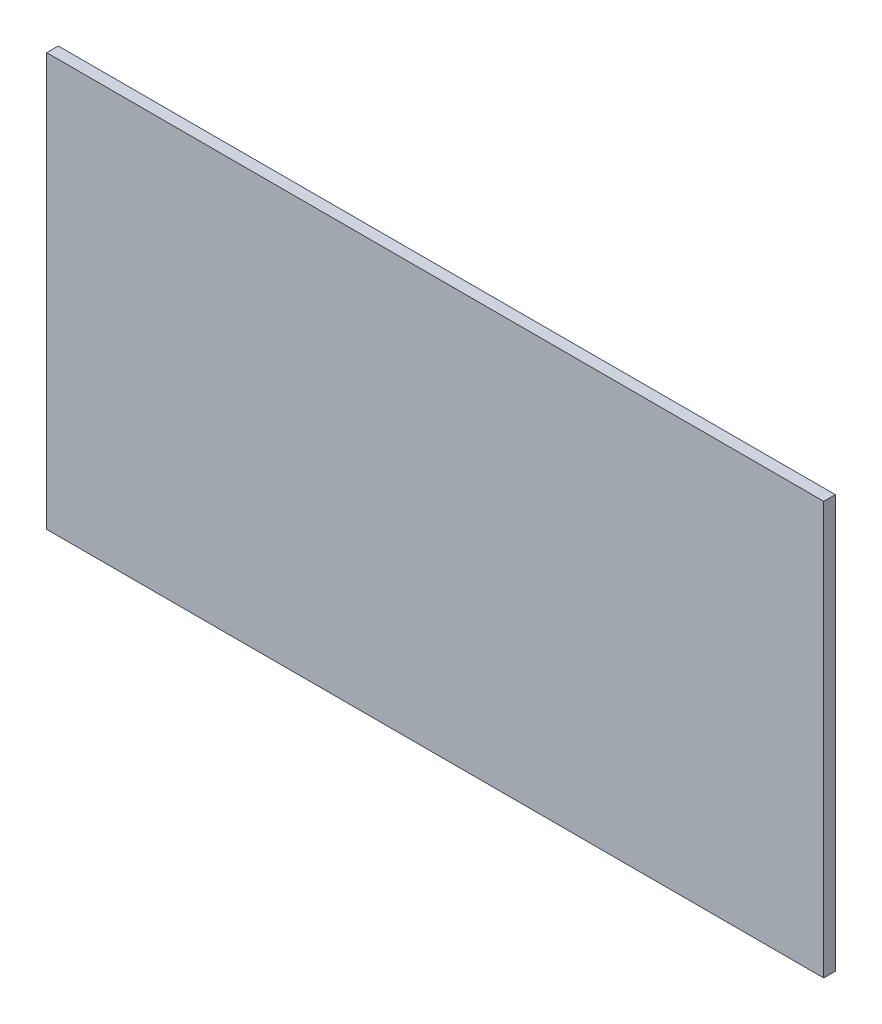
ISO-10303-21;
HEADER;
FILE_DESCRIPTION(('STEP AP214'),'2;1');
FILE_NAME('part.step','',(''),(''),'','','');
FILE_SCHEMA(('AUTOMOTIVE_DESIGN { 1 0 10303 214 1 1 1 1 }'));
ENDSEC;
DATA;
#1=APPLICATION_CONTEXT('core data for automotive mechanical design processes');
#2=APPLICATION_PROTOCOL_DEFINITION('international standard','automotive_design',2000,#1);
#3=PRODUCT_CONTEXT('',#1,'mechanical');
#4=PRODUCT('Part','Part','',(#3));
#5=PRODUCT_RELATED_PRODUCT_CATEGORY('part','',(#4));
#6=PRODUCT_DEFINITION_FORMATION('','',#4);
#7=PRODUCT_DEFINITION_CONTEXT('part definition',#1,'design');
#8=PRODUCT_DEFINITION('design','',#6,#7);
#9=PRODUCT_DEFINITION_SHAPE('','',#8);
#10=(LENGTH_UNIT() NAMED_UNIT(*) SI_UNIT(.MILLI.,.METRE.));
#11=(NAMED_UNIT(*) PLANE_ANGLE_UNIT() SI_UNIT($,.RADIAN.));
#12=(NAMED_UNIT(*) SI_UNIT($,.STERADIAN.) SOLID_ANGLE_UNIT());
#13=UNCERTAINTY_MEASURE_WITH_UNIT(LENGTH_MEASURE(1.E-05),#10,'distance_accuracy_value','');
#14=(GEOMETRIC_REPRESENTATION_CONTEXT(3) GLOBAL_UNCERTAINTY_ASSIGNED_CONTEXT((#13)) GLOBAL_UNIT_ASSIGNED_CONTEXT((#10,
#11,#12)) REPRESENTATION_CONTEXT('',''));
#15=CARTESIAN_POINT('',(0.,0.,0.));
#16=DIRECTION('',(0.,0.,1.));
#17=DIRECTION('',(1.,0.,0.));
#18=AXIS2_PLACEMENT_3D('',#15,#16,#17);
#19=CARTESIAN_POINT('',(1508.,0.,-15.));
#20=DIRECTION('',(1.,0.,0.));
#21=DIRECTION('',(0.,1.,0.));
#22=AXIS2_PLACEMENT_3D('',#19,#20,#21);
#23=PLANE('',#22);
#24=DIRECTION('',(0.,0.,1.));
#25=VECTOR('',#24,1.);
#26=CARTESIAN_POINT('',(1508.,-1435.,-15.));
#27=LINE('',#26,#25);
#28=CARTESIAN_POINT('',(1508.,-1435.,-15.));
#29=VERTEX_POINT('',#28);
#30=CARTESIAN_POINT('',(1508.,-1435.,0.));
#31=VERTEX_POINT('',#30);
#32=EDGE_CURVE('E77',#29,#31,#27,.T.);
#33=ORIENTED_EDGE('',*,*,#32,.T.);
#34=DIRECTION('',(0.,1.,0.));
#35=VECTOR('',#34,1.);
#36=CARTESIAN_POINT('',(1508.,0.,0.));
#37=LINE('',#36,#35);
#38=CARTESIAN_POINT('',(1508.,-1970.,0.));
#39=VERTEX_POINT('',#38);
#40=EDGE_CURVE('E99',#39,#31,#37,.T.);
#41=ORIENTED_EDGE('',*,*,#40,.F.);
#42=DIRECTION('',(0.,0.,1.));
#43=VECTOR('',#42,1.);
#44=CARTESIAN_POINT('',(1508.,-1970.,-15.));
#45=LINE('',#44,#43);
#46=CARTESIAN_POINT('',(1508.,-1970.,-15.));
#47=VERTEX_POINT('',#46);
#48=EDGE_CURVE('E46',#47,#39,#45,.T.);
#49=ORIENTED_EDGE('',*,*,#48,.F.);
#50=DIRECTION('',(0.,1.,0.));
#51=VECTOR('',#50,1.);
#52=CARTESIAN_POINT('',(1508.,0.,-15.));
#53=LINE('',#52,#51);
#54=EDGE_CURVE('E92',#47,#29,#53,.T.);
#55=ORIENTED_EDGE('',*,*,#54,.T.);
#56=EDGE_LOOP('',(#33,#41,#49,#55));
#57=FACE_BOUND('',#56,.T.);
#58=ADVANCED_FACE('F38',(#57),#23,.T.);
#59=CARTESIAN_POINT('',(2.41255419432029E-13,-1970.,-15.));
#60=DIRECTION('',(0.,-1.,0.));
#61=DIRECTION('',(0.,0.,-1.));
#62=AXIS2_PLACEMENT_3D('',#59,#60,#61);
#63=PLANE('',#62);
#64=DIRECTION('',(0.,0.,1.));
#65=VECTOR('',#64,1.);
#66=CARTESIAN_POINT('',(501.000000000001,-1970.,-15.));
#67=LINE('',#66,#65);
#68=CARTESIAN_POINT('',(501.000000000001,-1970.,-15.));
#69=VERTEX_POINT('',#68);
#70=CARTESIAN_POINT('',(501.000000000001,-1970.,0.));
#71=VERTEX_POINT('',#70);
#72=EDGE_CURVE('E60',#69,#71,#67,.T.);
#73=ORIENTED_EDGE('',*,*,#72,.F.);
#74=DIRECTION('',(1.,0.,0.));
#75=VECTOR('',#74,1.);
#76=CARTESIAN_POINT('',(2.41255419432029E-13,-1970.,-15.));
#77=LINE('',#76,#75);
#78=EDGE_CURVE('E97',#69,#47,#77,.T.);
#79=ORIENTED_EDGE('',*,*,#78,.T.);
#80=ORIENTED_EDGE('',*,*,#48,.T.);
#81=DIRECTION('',(1.,0.,0.));
#82=VECTOR('',#81,1.);
#83=CARTESIAN_POINT('',(2.41255419432029E-13,-1970.,0.));
#84=LINE('',#83,#82);
#85=EDGE_CURVE('E103',#71,#39,#84,.T.);
#86=ORIENTED_EDGE('',*,*,#85,.F.);
#87=EDGE_LOOP('',(#73,#79,#80,#86));
#88=FACE_BOUND('',#87,.T.);
#89=ADVANCED_FACE('F40',(#88),#63,.T.);
#90=CARTESIAN_POINT('',(0.,0.,-15.));
#91=DIRECTION('',(0.,0.,1.));
#92=DIRECTION('',(1.,0.,0.));
#93=AXIS2_PLACEMENT_3D('',#90,#91,#92);
#94=PLANE('',#93);
#95=DIRECTION('',(0.,1.,0.));
#96=VECTOR('',#95,1.);
#97=CARTESIAN_POINT('',(501.,0.,-15.));
#98=LINE('',#97,#96);
#99=CARTESIAN_POINT('',(501.,-1435.,-15.));
#100=VERTEX_POINT('',#99);
#101=EDGE_CURVE('E93',#69,#100,#98,.T.);
#102=ORIENTED_EDGE('',*,*,#101,.T.);
#103=DIRECTION('',(1.,0.,0.));
#104=VECTOR('',#103,1.);
#105=CARTESIAN_POINT('',(501.,-1435.,-15.));
#106=LINE('',#105,#104);
#107=EDGE_CURVE('E53',#100,#29,#106,.T.);
#108=ORIENTED_EDGE('',*,*,#107,.T.);
#109=ORIENTED_EDGE('',*,*,#54,.F.);
#110=ORIENTED_EDGE('',*,*,#78,.F.);
#111=EDGE_LOOP('',(#102,#108,#109,#110));
#112=FACE_BOUND('',#111,.T.);
#113=ADVANCED_FACE('F90',(#112),#94,.F.);
#114=CARTESIAN_POINT('',(0.,0.,0.));
#115=DIRECTION('',(0.,0.,1.));
#116=DIRECTION('',(1.,0.,0.));
#117=AXIS2_PLACEMENT_3D('',#114,#115,#116);
#118=PLANE('',#117);
#119=DIRECTION('',(1.,0.,0.));
#120=VECTOR('',#119,1.);
#121=CARTESIAN_POINT('',(0.,-1435.,0.));
#122=LINE('',#121,#120);
#123=CARTESIAN_POINT('',(501.,-1435.,0.));
#124=VERTEX_POINT('',#123);
#125=EDGE_CURVE('E80',#124,#31,#122,.T.);
#126=ORIENTED_EDGE('',*,*,#125,.F.);
#127=DIRECTION('',(0.,1.,0.));
#128=VECTOR('',#127,1.);
#129=CARTESIAN_POINT('',(501.,0.,0.));
#130=LINE('',#129,#128);
#131=EDGE_CURVE('E11',#71,#124,#130,.T.);
#132=ORIENTED_EDGE('',*,*,#131,.F.);
#133=ORIENTED_EDGE('',*,*,#85,.T.);
#134=ORIENTED_EDGE('',*,*,#40,.T.);
#135=EDGE_LOOP('',(#126,#132,#133,#134));
#136=FACE_BOUND('',#135,.T.);
#137=ADVANCED_FACE('F106',(#136),#118,.T.);
#138=CARTESIAN_POINT('',(501.,0.,-15.));
#139=DIRECTION('',(1.,0.,0.));
#140=DIRECTION('',(0.,1.,0.));
#141=AXIS2_PLACEMENT_3D('',#138,#139,#140);
#142=PLANE('',#141);
#143=ORIENTED_EDGE('',*,*,#131,.T.);
#144=DIRECTION('',(0.,0.,1.));
#145=VECTOR('',#144,1.);
#146=CARTESIAN_POINT('',(501.,-1435.,-15.));
#147=LINE('',#146,#145);
#148=EDGE_CURVE('E85',#100,#124,#147,.T.);
#149=ORIENTED_EDGE('',*,*,#148,.F.);
#150=ORIENTED_EDGE('',*,*,#101,.F.);
#151=ORIENTED_EDGE('',*,*,#72,.T.);
#152=EDGE_LOOP('',(#143,#149,#150,#151));
#153=FACE_BOUND('',#152,.T.);
#154=ADVANCED_FACE('F112',(#153),#142,.F.);
#155=CARTESIAN_POINT('',(501.,-1435.,-15.));
#156=DIRECTION('',(0.,-1.,0.));
#157=DIRECTION('',(0.,0.,-1.));
#158=AXIS2_PLACEMENT_3D('',#155,#156,#157);
#159=PLANE('',#158);
#160=ORIENTED_EDGE('',*,*,#125,.T.);
#161=ORIENTED_EDGE('',*,*,#32,.F.);
#162=ORIENTED_EDGE('',*,*,#107,.F.);
#163=ORIENTED_EDGE('',*,*,#148,.T.);
#164=EDGE_LOOP('',(#160,#161,#162,#163));
#165=FACE_BOUND('',#164,.T.);
#166=ADVANCED_FACE('F78',(#165),#159,.F.);
#167=CLOSED_SHELL('',(#58,#89,#113,#137,#154,#166));
#168=MANIFOLD_SOLID_BREP('B2',#167);
#169=ADVANCED_BREP_SHAPE_REPRESENTATION('',(#18,#168),#14);
#170=SHAPE_DEFINITION_REPRESENTATION(#9,#169);
ENDSEC;
END-ISO-10303-21;
